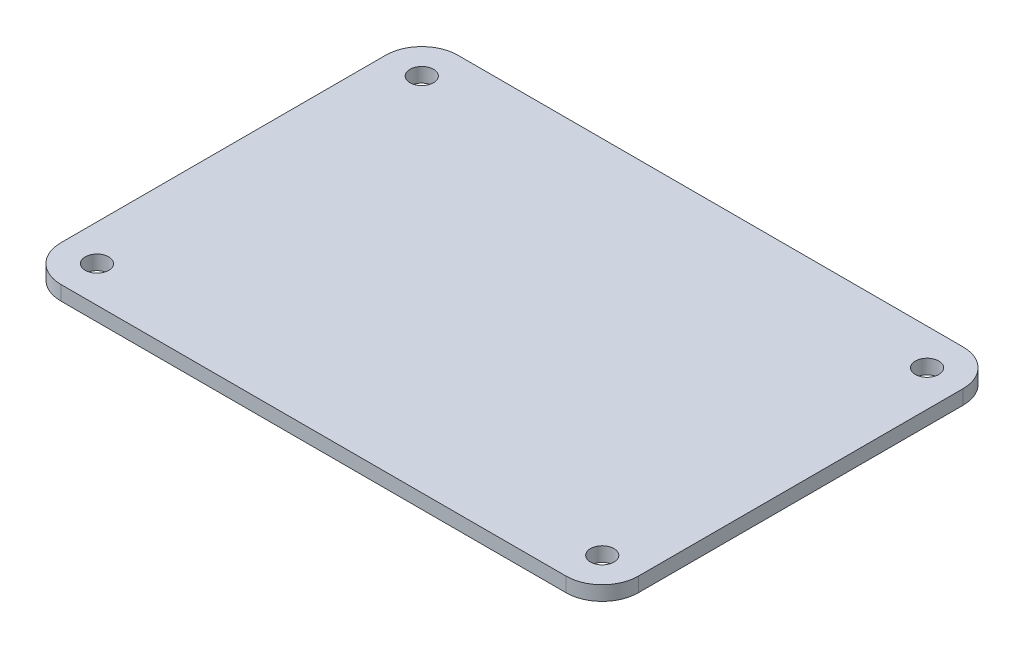
ISO-10303-21;
HEADER;
FILE_DESCRIPTION(('STEP AP214'),'2;1');
FILE_NAME('part.step','',(''),(''),'','','');
FILE_SCHEMA(('AUTOMOTIVE_DESIGN { 1 0 10303 214 1 1 1 1 }'));
ENDSEC;
DATA;
#1=APPLICATION_CONTEXT('core data for automotive mechanical design processes');
#2=APPLICATION_PROTOCOL_DEFINITION('international standard','automotive_design',2000,#1);
#3=PRODUCT_CONTEXT('',#1,'mechanical');
#4=PRODUCT('Part','Part','',(#3));
#5=PRODUCT_RELATED_PRODUCT_CATEGORY('part','',(#4));
#6=PRODUCT_DEFINITION_FORMATION('','',#4);
#7=PRODUCT_DEFINITION_CONTEXT('part definition',#1,'design');
#8=PRODUCT_DEFINITION('design','',#6,#7);
#9=PRODUCT_DEFINITION_SHAPE('','',#8);
#10=(LENGTH_UNIT() NAMED_UNIT(*) SI_UNIT(.MILLI.,.METRE.));
#11=(NAMED_UNIT(*) PLANE_ANGLE_UNIT() SI_UNIT($,.RADIAN.));
#12=(NAMED_UNIT(*) SI_UNIT($,.STERADIAN.) SOLID_ANGLE_UNIT());
#13=UNCERTAINTY_MEASURE_WITH_UNIT(LENGTH_MEASURE(1.E-05),#10,'distance_accuracy_value','');
#14=(GEOMETRIC_REPRESENTATION_CONTEXT(3) GLOBAL_UNCERTAINTY_ASSIGNED_CONTEXT((#13)) GLOBAL_UNIT_ASSIGNED_CONTEXT((#10,
#11,#12)) REPRESENTATION_CONTEXT('',''));
#15=CARTESIAN_POINT('',(0.,0.,0.));
#16=DIRECTION('',(0.,0.,1.));
#17=DIRECTION('',(1.,0.,0.));
#18=AXIS2_PLACEMENT_3D('',#15,#16,#17);
#19=CARTESIAN_POINT('',(0.,4.,-55.));
#20=DIRECTION('',(0.,0.,1.));
#21=DIRECTION('',(1.,0.,0.));
#22=AXIS2_PLACEMENT_3D('',#19,#20,#21);
#23=PLANE('',#22);
#24=DIRECTION('',(-1.,0.,0.));
#25=VECTOR('',#24,1.);
#26=CARTESIAN_POINT('',(0.,0.,-55.));
#27=LINE('',#26,#25);
#28=CARTESIAN_POINT('',(69.9999999999999,0.,-55.));
#29=VERTEX_POINT('',#28);
#30=CARTESIAN_POINT('',(-70.,0.,-55.));
#31=VERTEX_POINT('',#30);
#32=EDGE_CURVE('E147',#29,#31,#27,.T.);
#33=ORIENTED_EDGE('',*,*,#32,.T.);
#34=DIRECTION('',(0.,-1.,0.));
#35=VECTOR('',#34,1.);
#36=CARTESIAN_POINT('',(-70.,4.,-55.));
#37=LINE('',#36,#35);
#38=CARTESIAN_POINT('',(-70.,4.,-55.));
#39=VERTEX_POINT('',#38);
#40=EDGE_CURVE('E11',#39,#31,#37,.T.);
#41=ORIENTED_EDGE('',*,*,#40,.F.);
#42=DIRECTION('',(-1.,0.,0.));
#43=VECTOR('',#42,1.);
#44=CARTESIAN_POINT('',(0.,4.,-55.));
#45=LINE('',#44,#43);
#46=CARTESIAN_POINT('',(69.9999999999999,4.,-55.));
#47=VERTEX_POINT('',#46);
#48=EDGE_CURVE('E192',#47,#39,#45,.T.);
#49=ORIENTED_EDGE('',*,*,#48,.F.);
#50=DIRECTION('',(0.,-1.,0.));
#51=VECTOR('',#50,1.);
#52=CARTESIAN_POINT('',(69.9999999999999,4.,-55.));
#53=LINE('',#52,#51);
#54=EDGE_CURVE('E131',#47,#29,#53,.T.);
#55=ORIENTED_EDGE('',*,*,#54,.T.);
#56=EDGE_LOOP('',(#33,#41,#49,#55));
#57=FACE_BOUND('',#56,.T.);
#58=ADVANCED_FACE('F39',(#57),#23,.F.);
#59=CARTESIAN_POINT('',(-70.,4.,-45.));
#60=DIRECTION('',(0.,-1.,0.));
#61=DIRECTION('',(0.,0.,-1.));
#62=AXIS2_PLACEMENT_3D('',#59,#60,#61);
#63=CYLINDRICAL_SURFACE('',#62,10.);
#64=CARTESIAN_POINT('',(-70.,0.,-45.));
#65=DIRECTION('',(0.,1.,0.));
#66=DIRECTION('',(0.,0.,1.));
#67=AXIS2_PLACEMENT_3D('',#64,#65,#66);
#68=CIRCLE('',#67,10.);
#69=CARTESIAN_POINT('',(-80.,0.,-44.9999999999999));
#70=VERTEX_POINT('',#69);
#71=EDGE_CURVE('E150',#31,#70,#68,.T.);
#72=ORIENTED_EDGE('',*,*,#71,.T.);
#73=DIRECTION('',(0.,-1.,0.));
#74=VECTOR('',#73,1.);
#75=CARTESIAN_POINT('',(-80.,4.,-44.9999999999999));
#76=LINE('',#75,#74);
#77=CARTESIAN_POINT('',(-80.,4.,-44.9999999999999));
#78=VERTEX_POINT('',#77);
#79=EDGE_CURVE('E48',#78,#70,#76,.T.);
#80=ORIENTED_EDGE('',*,*,#79,.F.);
#81=CARTESIAN_POINT('',(-70.,4.,-45.));
#82=DIRECTION('',(0.,1.,0.));
#83=DIRECTION('',(0.,0.,1.));
#84=AXIS2_PLACEMENT_3D('',#81,#82,#83);
#85=CIRCLE('',#84,10.);
#86=EDGE_CURVE('E99',#39,#78,#85,.T.);
#87=ORIENTED_EDGE('',*,*,#86,.F.);
#88=ORIENTED_EDGE('',*,*,#40,.T.);
#89=EDGE_LOOP('',(#72,#80,#87,#88));
#90=FACE_BOUND('',#89,.T.);
#91=ADVANCED_FACE('F178',(#90),#63,.T.);
#92=CARTESIAN_POINT('',(-80.,4.,0.));
#93=DIRECTION('',(-1.,0.,0.));
#94=DIRECTION('',(0.,0.,1.));
#95=AXIS2_PLACEMENT_3D('',#92,#93,#94);
#96=PLANE('',#95);
#97=DIRECTION('',(0.,0.,-1.));
#98=VECTOR('',#97,1.);
#99=CARTESIAN_POINT('',(-80.,0.,0.));
#100=LINE('',#99,#98);
#101=CARTESIAN_POINT('',(-80.,0.,44.9999999999999));
#102=VERTEX_POINT('',#101);
#103=EDGE_CURVE('E153',#102,#70,#100,.T.);
#104=ORIENTED_EDGE('',*,*,#103,.F.);
#105=DIRECTION('',(0.,-1.,0.));
#106=VECTOR('',#105,1.);
#107=CARTESIAN_POINT('',(-80.,4.,44.9999999999999));
#108=LINE('',#107,#106);
#109=CARTESIAN_POINT('',(-80.,4.,44.9999999999999));
#110=VERTEX_POINT('',#109);
#111=EDGE_CURVE('E171',#110,#102,#108,.T.);
#112=ORIENTED_EDGE('',*,*,#111,.F.);
#113=DIRECTION('',(0.,0.,-1.));
#114=VECTOR('',#113,1.);
#115=CARTESIAN_POINT('',(-80.,4.,0.));
#116=LINE('',#115,#114);
#117=EDGE_CURVE('E177',#110,#78,#116,.T.);
#118=ORIENTED_EDGE('',*,*,#117,.T.);
#119=ORIENTED_EDGE('',*,*,#79,.T.);
#120=EDGE_LOOP('',(#104,#112,#118,#119));
#121=FACE_BOUND('',#120,.T.);
#122=ADVANCED_FACE('F175',(#121),#96,.T.);
#123=CARTESIAN_POINT('',(-70.,4.,45.));
#124=DIRECTION('',(0.,-1.,0.));
#125=DIRECTION('',(0.,0.,-1.));
#126=AXIS2_PLACEMENT_3D('',#123,#124,#125);
#127=CYLINDRICAL_SURFACE('',#126,10.);
#128=CARTESIAN_POINT('',(-70.,0.,45.));
#129=DIRECTION('',(0.,1.,0.));
#130=DIRECTION('',(0.,0.,1.));
#131=AXIS2_PLACEMENT_3D('',#128,#129,#130);
#132=CIRCLE('',#131,10.);
#133=CARTESIAN_POINT('',(-70.,0.,55.));
#134=VERTEX_POINT('',#133);
#135=EDGE_CURVE('E156',#102,#134,#132,.T.);
#136=ORIENTED_EDGE('',*,*,#135,.T.);
#137=DIRECTION('',(0.,-1.,0.));
#138=VECTOR('',#137,1.);
#139=CARTESIAN_POINT('',(-70.,4.,55.));
#140=LINE('',#139,#138);
#141=CARTESIAN_POINT('',(-70.,4.,55.));
#142=VERTEX_POINT('',#141);
#143=EDGE_CURVE('E169',#142,#134,#140,.T.);
#144=ORIENTED_EDGE('',*,*,#143,.F.);
#145=CARTESIAN_POINT('',(-70.,4.,45.));
#146=DIRECTION('',(0.,1.,0.));
#147=DIRECTION('',(0.,0.,1.));
#148=AXIS2_PLACEMENT_3D('',#145,#146,#147);
#149=CIRCLE('',#148,10.);
#150=EDGE_CURVE('E189',#110,#142,#149,.T.);
#151=ORIENTED_EDGE('',*,*,#150,.F.);
#152=ORIENTED_EDGE('',*,*,#111,.T.);
#153=EDGE_LOOP('',(#136,#144,#151,#152));
#154=FACE_BOUND('',#153,.T.);
#155=ADVANCED_FACE('F187',(#154),#127,.T.);
#156=CARTESIAN_POINT('',(0.,4.,55.));
#157=DIRECTION('',(0.,0.,1.));
#158=DIRECTION('',(1.,0.,0.));
#159=AXIS2_PLACEMENT_3D('',#156,#157,#158);
#160=PLANE('',#159);
#161=DIRECTION('',(-1.,0.,0.));
#162=VECTOR('',#161,1.);
#163=CARTESIAN_POINT('',(0.,0.,55.));
#164=LINE('',#163,#162);
#165=CARTESIAN_POINT('',(69.9999999999999,0.,55.));
#166=VERTEX_POINT('',#165);
#167=EDGE_CURVE('E159',#166,#134,#164,.T.);
#168=ORIENTED_EDGE('',*,*,#167,.F.);
#169=DIRECTION('',(0.,-1.,0.));
#170=VECTOR('',#169,1.);
#171=CARTESIAN_POINT('',(69.9999999999999,4.,55.));
#172=LINE('',#171,#170);
#173=CARTESIAN_POINT('',(69.9999999999999,4.,55.));
#174=VERTEX_POINT('',#173);
#175=EDGE_CURVE('E126',#174,#166,#172,.T.);
#176=ORIENTED_EDGE('',*,*,#175,.F.);
#177=DIRECTION('',(-1.,0.,0.));
#178=VECTOR('',#177,1.);
#179=CARTESIAN_POINT('',(0.,4.,55.));
#180=LINE('',#179,#178);
#181=EDGE_CURVE('E119',#174,#142,#180,.T.);
#182=ORIENTED_EDGE('',*,*,#181,.T.);
#183=ORIENTED_EDGE('',*,*,#143,.T.);
#184=EDGE_LOOP('',(#168,#176,#182,#183));
#185=FACE_BOUND('',#184,.T.);
#186=ADVANCED_FACE('F196',(#185),#160,.T.);
#187=CARTESIAN_POINT('',(70.,4.,45.));
#188=DIRECTION('',(0.,-1.,0.));
#189=DIRECTION('',(0.,0.,-1.));
#190=AXIS2_PLACEMENT_3D('',#187,#188,#189);
#191=CYLINDRICAL_SURFACE('',#190,10.);
#192=CARTESIAN_POINT('',(70.,0.,45.));
#193=DIRECTION('',(0.,1.,0.));
#194=DIRECTION('',(0.,0.,1.));
#195=AXIS2_PLACEMENT_3D('',#192,#193,#194);
#196=CIRCLE('',#195,10.);
#197=CARTESIAN_POINT('',(80.,0.,44.9999999999999));
#198=VERTEX_POINT('',#197);
#199=EDGE_CURVE('E125',#166,#198,#196,.T.);
#200=ORIENTED_EDGE('',*,*,#199,.T.);
#201=DIRECTION('',(0.,-1.,0.));
#202=VECTOR('',#201,1.);
#203=CARTESIAN_POINT('',(80.,4.,44.9999999999999));
#204=LINE('',#203,#202);
#205=CARTESIAN_POINT('',(80.,4.,44.9999999999999));
#206=VERTEX_POINT('',#205);
#207=EDGE_CURVE('E122',#206,#198,#204,.T.);
#208=ORIENTED_EDGE('',*,*,#207,.F.);
#209=CARTESIAN_POINT('',(70.,4.,45.));
#210=DIRECTION('',(0.,1.,0.));
#211=DIRECTION('',(0.,0.,1.));
#212=AXIS2_PLACEMENT_3D('',#209,#210,#211);
#213=CIRCLE('',#212,10.);
#214=EDGE_CURVE('E113',#174,#206,#213,.T.);
#215=ORIENTED_EDGE('',*,*,#214,.F.);
#216=ORIENTED_EDGE('',*,*,#175,.T.);
#217=EDGE_LOOP('',(#200,#208,#215,#216));
#218=FACE_BOUND('',#217,.T.);
#219=ADVANCED_FACE('F123',(#218),#191,.T.);
#220=CARTESIAN_POINT('',(80.,4.,0.));
#221=DIRECTION('',(-1.,0.,0.));
#222=DIRECTION('',(0.,0.,1.));
#223=AXIS2_PLACEMENT_3D('',#220,#221,#222);
#224=PLANE('',#223);
#225=DIRECTION('',(0.,0.,-1.));
#226=VECTOR('',#225,1.);
#227=CARTESIAN_POINT('',(80.,0.,0.));
#228=LINE('',#227,#226);
#229=CARTESIAN_POINT('',(80.,0.,-45.));
#230=VERTEX_POINT('',#229);
#231=EDGE_CURVE('E85',#198,#230,#228,.T.);
#232=ORIENTED_EDGE('',*,*,#231,.T.);
#233=DIRECTION('',(0.,-1.,0.));
#234=VECTOR('',#233,1.);
#235=CARTESIAN_POINT('',(80.,4.,-45.));
#236=LINE('',#235,#234);
#237=CARTESIAN_POINT('',(80.,4.,-45.));
#238=VERTEX_POINT('',#237);
#239=EDGE_CURVE('E127',#238,#230,#236,.T.);
#240=ORIENTED_EDGE('',*,*,#239,.F.);
#241=DIRECTION('',(0.,0.,-1.));
#242=VECTOR('',#241,1.);
#243=CARTESIAN_POINT('',(80.,4.,0.));
#244=LINE('',#243,#242);
#245=EDGE_CURVE('E117',#206,#238,#244,.T.);
#246=ORIENTED_EDGE('',*,*,#245,.F.);
#247=ORIENTED_EDGE('',*,*,#207,.T.);
#248=EDGE_LOOP('',(#232,#240,#246,#247));
#249=FACE_BOUND('',#248,.T.);
#250=ADVANCED_FACE('F129',(#249),#224,.F.);
#251=CARTESIAN_POINT('',(-70.,4.,-45.));
#252=DIRECTION('',(0.,-1.,0.));
#253=DIRECTION('',(0.,0.,-1.));
#254=AXIS2_PLACEMENT_3D('',#251,#252,#253);
#255=CYLINDRICAL_SURFACE('',#254,3.25000000000001);
#256=CARTESIAN_POINT('',(-70.,4.,-45.));
#257=DIRECTION('',(0.,1.,0.));
#258=DIRECTION('',(0.,0.,1.));
#259=AXIS2_PLACEMENT_3D('',#256,#257,#258);
#260=CIRCLE('',#259,3.25000000000001);
#261=CARTESIAN_POINT('',(-70.,4.,-41.75));
#262=VERTEX_POINT('',#261);
#263=EDGE_CURVE('E337',#262,#262,#260,.T.);
#264=ORIENTED_EDGE('',*,*,#263,.T.);
#265=EDGE_LOOP('',(#264));
#266=FACE_BOUND('',#265,.T.);
#267=CARTESIAN_POINT('',(-70.,0.,-45.));
#268=DIRECTION('',(0.,1.,0.));
#269=DIRECTION('',(0.,0.,1.));
#270=AXIS2_PLACEMENT_3D('',#267,#268,#269);
#271=CIRCLE('',#270,3.25000000000001);
#272=CARTESIAN_POINT('',(-70.,0.,-41.75));
#273=VERTEX_POINT('',#272);
#274=EDGE_CURVE('E144',#273,#273,#271,.T.);
#275=ORIENTED_EDGE('',*,*,#274,.F.);
#276=EDGE_LOOP('',(#275));
#277=FACE_BOUND('',#276,.T.);
#278=ADVANCED_FACE('F220',(#266,#277),#255,.F.);
#279=CARTESIAN_POINT('',(-70.,4.,45.));
#280=DIRECTION('',(0.,-1.,0.));
#281=DIRECTION('',(0.,0.,-1.));
#282=AXIS2_PLACEMENT_3D('',#279,#280,#281);
#283=CYLINDRICAL_SURFACE('',#282,3.25000000000001);
#284=CARTESIAN_POINT('',(-70.,4.,45.));
#285=DIRECTION('',(0.,1.,0.));
#286=DIRECTION('',(0.,0.,1.));
#287=AXIS2_PLACEMENT_3D('',#284,#285,#286);
#288=CIRCLE('',#287,3.25000000000001);
#289=CARTESIAN_POINT('',(-70.,4.,48.25));
#290=VERTEX_POINT('',#289);
#291=EDGE_CURVE('E334',#290,#290,#288,.T.);
#292=ORIENTED_EDGE('',*,*,#291,.T.);
#293=EDGE_LOOP('',(#292));
#294=FACE_BOUND('',#293,.T.);
#295=CARTESIAN_POINT('',(-70.,0.,45.));
#296=DIRECTION('',(0.,1.,0.));
#297=DIRECTION('',(0.,0.,1.));
#298=AXIS2_PLACEMENT_3D('',#295,#296,#297);
#299=CIRCLE('',#298,3.25000000000001);
#300=CARTESIAN_POINT('',(-70.,0.,48.25));
#301=VERTEX_POINT('',#300);
#302=EDGE_CURVE('E141',#301,#301,#299,.T.);
#303=ORIENTED_EDGE('',*,*,#302,.F.);
#304=EDGE_LOOP('',(#303));
#305=FACE_BOUND('',#304,.T.);
#306=ADVANCED_FACE('F223',(#294,#305),#283,.F.);
#307=CARTESIAN_POINT('',(70.,4.,45.));
#308=DIRECTION('',(0.,-1.,0.));
#309=DIRECTION('',(0.,0.,-1.));
#310=AXIS2_PLACEMENT_3D('',#307,#308,#309);
#311=CYLINDRICAL_SURFACE('',#310,3.25000000000001);
#312=CARTESIAN_POINT('',(70.,4.,45.));
#313=DIRECTION('',(0.,1.,0.));
#314=DIRECTION('',(0.,0.,1.));
#315=AXIS2_PLACEMENT_3D('',#312,#313,#314);
#316=CIRCLE('',#315,3.25000000000001);
#317=CARTESIAN_POINT('',(70.,4.,48.25));
#318=VERTEX_POINT('',#317);
#319=EDGE_CURVE('E234',#318,#318,#316,.T.);
#320=ORIENTED_EDGE('',*,*,#319,.T.);
#321=EDGE_LOOP('',(#320));
#322=FACE_BOUND('',#321,.T.);
#323=CARTESIAN_POINT('',(70.,0.,45.));
#324=DIRECTION('',(0.,1.,0.));
#325=DIRECTION('',(0.,0.,1.));
#326=AXIS2_PLACEMENT_3D('',#323,#324,#325);
#327=CIRCLE('',#326,3.25000000000001);
#328=CARTESIAN_POINT('',(70.,0.,48.25));
#329=VERTEX_POINT('',#328);
#330=EDGE_CURVE('E138',#329,#329,#327,.T.);
#331=ORIENTED_EDGE('',*,*,#330,.F.);
#332=EDGE_LOOP('',(#331));
#333=FACE_BOUND('',#332,.T.);
#334=ADVANCED_FACE('F208',(#322,#333),#311,.F.);
#335=CARTESIAN_POINT('',(70.,4.,-45.));
#336=DIRECTION('',(0.,-1.,0.));
#337=DIRECTION('',(0.,0.,-1.));
#338=AXIS2_PLACEMENT_3D('',#335,#336,#337);
#339=CYLINDRICAL_SURFACE('',#338,3.25000000000001);
#340=CARTESIAN_POINT('',(70.,4.,-45.));
#341=DIRECTION('',(0.,1.,0.));
#342=DIRECTION('',(0.,0.,1.));
#343=AXIS2_PLACEMENT_3D('',#340,#341,#342);
#344=CIRCLE('',#343,3.25000000000001);
#345=CARTESIAN_POINT('',(70.,4.,-41.75));
#346=VERTEX_POINT('',#345);
#347=EDGE_CURVE('E165',#346,#346,#344,.T.);
#348=ORIENTED_EDGE('',*,*,#347,.T.);
#349=EDGE_LOOP('',(#348));
#350=FACE_BOUND('',#349,.T.);
#351=CARTESIAN_POINT('',(70.,0.,-45.));
#352=DIRECTION('',(0.,1.,0.));
#353=DIRECTION('',(0.,0.,1.));
#354=AXIS2_PLACEMENT_3D('',#351,#352,#353);
#355=CIRCLE('',#354,3.25000000000001);
#356=CARTESIAN_POINT('',(70.,0.,-41.75));
#357=VERTEX_POINT('',#356);
#358=EDGE_CURVE('E135',#357,#357,#355,.T.);
#359=ORIENTED_EDGE('',*,*,#358,.F.);
#360=EDGE_LOOP('',(#359));
#361=FACE_BOUND('',#360,.T.);
#362=ADVANCED_FACE('F41',(#350,#361),#339,.F.);
#363=CARTESIAN_POINT('',(70.,4.,-45.));
#364=DIRECTION('',(0.,-1.,0.));
#365=DIRECTION('',(0.,0.,-1.));
#366=AXIS2_PLACEMENT_3D('',#363,#364,#365);
#367=CYLINDRICAL_SURFACE('',#366,10.);
#368=CARTESIAN_POINT('',(70.,0.,-45.));
#369=DIRECTION('',(0.,1.,0.));
#370=DIRECTION('',(0.,0.,1.));
#371=AXIS2_PLACEMENT_3D('',#368,#369,#370);
#372=CIRCLE('',#371,10.);
#373=EDGE_CURVE('E91',#230,#29,#372,.T.);
#374=ORIENTED_EDGE('',*,*,#373,.T.);
#375=ORIENTED_EDGE('',*,*,#54,.F.);
#376=CARTESIAN_POINT('',(70.,4.,-45.));
#377=DIRECTION('',(0.,1.,0.));
#378=DIRECTION('',(0.,0.,1.));
#379=AXIS2_PLACEMENT_3D('',#376,#377,#378);
#380=CIRCLE('',#379,10.);
#381=EDGE_CURVE('E56',#238,#47,#380,.T.);
#382=ORIENTED_EDGE('',*,*,#381,.F.);
#383=ORIENTED_EDGE('',*,*,#239,.T.);
#384=EDGE_LOOP('',(#374,#375,#382,#383));
#385=FACE_BOUND('',#384,.T.);
#386=ADVANCED_FACE('F199',(#385),#367,.T.);
#387=CARTESIAN_POINT('',(0.,4.,0.));
#388=DIRECTION('',(0.,1.,0.));
#389=DIRECTION('',(0.,0.,1.));
#390=AXIS2_PLACEMENT_3D('',#387,#388,#389);
#391=PLANE('',#390);
#392=ORIENTED_EDGE('',*,*,#347,.F.);
#393=EDGE_LOOP('',(#392));
#394=FACE_BOUND('',#393,.T.);
#395=ORIENTED_EDGE('',*,*,#319,.F.);
#396=EDGE_LOOP('',(#395));
#397=FACE_BOUND('',#396,.T.);
#398=ORIENTED_EDGE('',*,*,#291,.F.);
#399=EDGE_LOOP('',(#398));
#400=FACE_BOUND('',#399,.T.);
#401=ORIENTED_EDGE('',*,*,#263,.F.);
#402=EDGE_LOOP('',(#401));
#403=FACE_BOUND('',#402,.T.);
#404=ORIENTED_EDGE('',*,*,#48,.T.);
#405=ORIENTED_EDGE('',*,*,#86,.T.);
#406=ORIENTED_EDGE('',*,*,#117,.F.);
#407=ORIENTED_EDGE('',*,*,#150,.T.);
#408=ORIENTED_EDGE('',*,*,#181,.F.);
#409=ORIENTED_EDGE('',*,*,#214,.T.);
#410=ORIENTED_EDGE('',*,*,#245,.T.);
#411=ORIENTED_EDGE('',*,*,#381,.T.);
#412=EDGE_LOOP('',(#404,#405,#406,#407,#408,#409,#410,#411));
#413=FACE_BOUND('',#412,.T.);
#414=ADVANCED_FACE('F115',(#394,#397,#400,#403,#413),#391,.T.);
#415=CARTESIAN_POINT('',(0.,0.,0.));
#416=DIRECTION('',(0.,1.,0.));
#417=DIRECTION('',(0.,0.,1.));
#418=AXIS2_PLACEMENT_3D('',#415,#416,#417);
#419=PLANE('',#418);
#420=ORIENTED_EDGE('',*,*,#358,.T.);
#421=EDGE_LOOP('',(#420));
#422=FACE_BOUND('',#421,.T.);
#423=ORIENTED_EDGE('',*,*,#330,.T.);
#424=EDGE_LOOP('',(#423));
#425=FACE_BOUND('',#424,.T.);
#426=ORIENTED_EDGE('',*,*,#302,.T.);
#427=EDGE_LOOP('',(#426));
#428=FACE_BOUND('',#427,.T.);
#429=ORIENTED_EDGE('',*,*,#274,.T.);
#430=EDGE_LOOP('',(#429));
#431=FACE_BOUND('',#430,.T.);
#432=ORIENTED_EDGE('',*,*,#32,.F.);
#433=ORIENTED_EDGE('',*,*,#373,.F.);
#434=ORIENTED_EDGE('',*,*,#231,.F.);
#435=ORIENTED_EDGE('',*,*,#199,.F.);
#436=ORIENTED_EDGE('',*,*,#167,.T.);
#437=ORIENTED_EDGE('',*,*,#135,.F.);
#438=ORIENTED_EDGE('',*,*,#103,.T.);
#439=ORIENTED_EDGE('',*,*,#71,.F.);
#440=EDGE_LOOP('',(#432,#433,#434,#435,#436,#437,#438,#439));
#441=FACE_BOUND('',#440,.T.);
#442=ADVANCED_FACE('F183',(#422,#425,#428,#431,#441),#419,.F.);
#443=CLOSED_SHELL('',(#58,#91,#122,#155,#186,#219,#250,#278,#306,#334,#362,#386,#414,#442));
#444=MANIFOLD_SOLID_BREP('B2',#443);
#445=ADVANCED_BREP_SHAPE_REPRESENTATION('',(#18,#444),#14);
#446=SHAPE_DEFINITION_REPRESENTATION(#9,#445);
ENDSEC;
END-ISO-10303-21;
